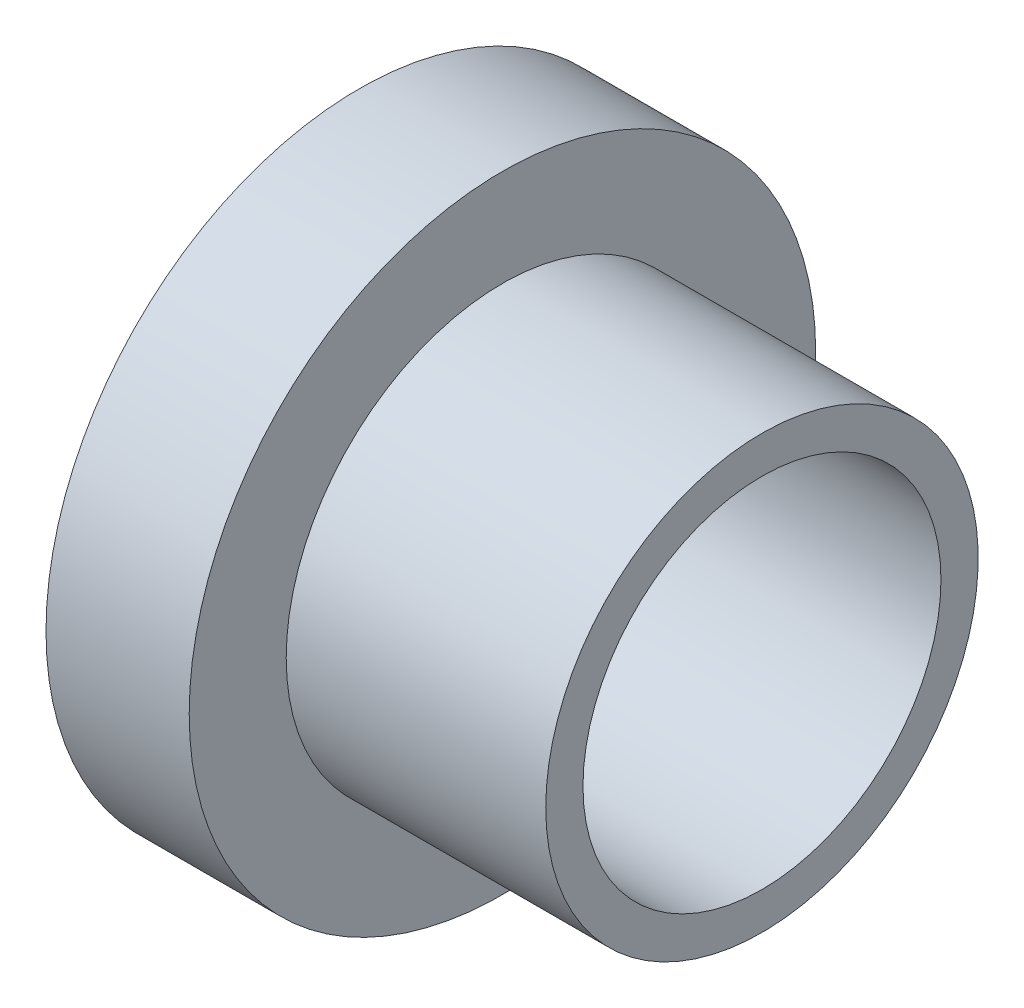
ISO-10303-21;
HEADER;
FILE_DESCRIPTION(('STEP AP214'),'2;1');
FILE_NAME('part.step','',(''),(''),'','','');
FILE_SCHEMA(('AUTOMOTIVE_DESIGN { 1 0 10303 214 1 1 1 1 }'));
ENDSEC;
DATA;
#1=APPLICATION_CONTEXT('core data for automotive mechanical design processes');
#2=APPLICATION_PROTOCOL_DEFINITION('international standard','automotive_design',2000,#1);
#3=PRODUCT_CONTEXT('',#1,'mechanical');
#4=PRODUCT('Part','Part','',(#3));
#5=PRODUCT_RELATED_PRODUCT_CATEGORY('part','',(#4));
#6=PRODUCT_DEFINITION_FORMATION('','',#4);
#7=PRODUCT_DEFINITION_CONTEXT('part definition',#1,'design');
#8=PRODUCT_DEFINITION('design','',#6,#7);
#9=PRODUCT_DEFINITION_SHAPE('','',#8);
#10=(LENGTH_UNIT() NAMED_UNIT(*) SI_UNIT(.MILLI.,.METRE.));
#11=(NAMED_UNIT(*) PLANE_ANGLE_UNIT() SI_UNIT($,.RADIAN.));
#12=(NAMED_UNIT(*) SI_UNIT($,.STERADIAN.) SOLID_ANGLE_UNIT());
#13=UNCERTAINTY_MEASURE_WITH_UNIT(LENGTH_MEASURE(1.E-05),#10,'distance_accuracy_value','');
#14=(GEOMETRIC_REPRESENTATION_CONTEXT(3) GLOBAL_UNCERTAINTY_ASSIGNED_CONTEXT((#13)) GLOBAL_UNIT_ASSIGNED_CONTEXT((#10,
#11,#12)) REPRESENTATION_CONTEXT('',''));
#15=CARTESIAN_POINT('',(0.,0.,0.));
#16=DIRECTION('',(0.,0.,1.));
#17=DIRECTION('',(1.,0.,0.));
#18=AXIS2_PLACEMENT_3D('',#15,#16,#17);
#19=CARTESIAN_POINT('',(0.,-5.,0.));
#20=DIRECTION('',(-1.,0.,0.));
#21=DIRECTION('',(0.,0.,1.));
#22=AXIS2_PLACEMENT_3D('',#19,#20,#21);
#23=CYLINDRICAL_SURFACE('',#22,5.);
#24=CARTESIAN_POINT('',(11.25,-5.,0.));
#25=DIRECTION('',(-1.,0.,0.));
#26=DIRECTION('',(0.,0.,1.));
#27=AXIS2_PLACEMENT_3D('',#24,#25,#26);
#28=CIRCLE('',#27,5.);
#29=CARTESIAN_POINT('',(11.25,-5.,5.));
#30=VERTEX_POINT('',#29);
#31=EDGE_CURVE('E10',#30,#30,#28,.T.);
#32=ORIENTED_EDGE('',*,*,#31,.F.);
#33=EDGE_LOOP('',(#32));
#34=FACE_BOUND('',#33,.T.);
#35=CARTESIAN_POINT('',(0.,-5.,0.));
#36=DIRECTION('',(-1.,0.,0.));
#37=DIRECTION('',(0.,0.,1.));
#38=AXIS2_PLACEMENT_3D('',#35,#36,#37);
#39=CIRCLE('',#38,5.);
#40=CARTESIAN_POINT('',(0.,-5.,5.));
#41=VERTEX_POINT('',#40);
#42=EDGE_CURVE('E53',#41,#41,#39,.T.);
#43=ORIENTED_EDGE('',*,*,#42,.T.);
#44=EDGE_LOOP('',(#43));
#45=FACE_BOUND('',#44,.T.);
#46=ADVANCED_FACE('F31',(#34,#45),#23,.F.);
#47=CARTESIAN_POINT('',(11.25,0.,0.));
#48=DIRECTION('',(-1.,0.,0.));
#49=DIRECTION('',(0.,0.,1.));
#50=AXIS2_PLACEMENT_3D('',#47,#48,#49);
#51=PLANE('',#50);
#52=CARTESIAN_POINT('',(11.25,-5.,0.));
#53=DIRECTION('',(-1.,0.,0.));
#54=DIRECTION('',(0.,0.,1.));
#55=AXIS2_PLACEMENT_3D('',#52,#53,#54);
#56=CIRCLE('',#55,6.04);
#57=CARTESIAN_POINT('',(11.25,-5.,6.04));
#58=VERTEX_POINT('',#57);
#59=EDGE_CURVE('E37',#58,#58,#56,.T.);
#60=ORIENTED_EDGE('',*,*,#59,.F.);
#61=EDGE_LOOP('',(#60));
#62=FACE_BOUND('',#61,.T.);
#63=ORIENTED_EDGE('',*,*,#31,.T.);
#64=EDGE_LOOP('',(#63));
#65=FACE_BOUND('',#64,.T.);
#66=ADVANCED_FACE('F78',(#62,#65),#51,.F.);
#67=CARTESIAN_POINT('',(0.,-5.,0.));
#68=DIRECTION('',(-1.,0.,0.));
#69=DIRECTION('',(0.,0.,1.));
#70=AXIS2_PLACEMENT_3D('',#67,#68,#69);
#71=CYLINDRICAL_SURFACE('',#70,6.04);
#72=CARTESIAN_POINT('',(4.,-5.,0.));
#73=DIRECTION('',(-1.,0.,0.));
#74=DIRECTION('',(0.,0.,1.));
#75=AXIS2_PLACEMENT_3D('',#72,#73,#74);
#76=CIRCLE('',#75,6.04);
#77=CARTESIAN_POINT('',(4.,-5.,6.04));
#78=VERTEX_POINT('',#77);
#79=EDGE_CURVE('E41',#78,#78,#76,.T.);
#80=ORIENTED_EDGE('',*,*,#79,.F.);
#81=EDGE_LOOP('',(#80));
#82=FACE_BOUND('',#81,.T.);
#83=ORIENTED_EDGE('',*,*,#59,.T.);
#84=EDGE_LOOP('',(#83));
#85=FACE_BOUND('',#84,.T.);
#86=ADVANCED_FACE('F73',(#82,#85),#71,.T.);
#87=CARTESIAN_POINT('',(4.,1.04,0.));
#88=DIRECTION('',(-1.,0.,0.));
#89=DIRECTION('',(0.,0.,1.));
#90=AXIS2_PLACEMENT_3D('',#87,#88,#89);
#91=PLANE('',#90);
#92=CARTESIAN_POINT('',(4.,-5.,0.));
#93=DIRECTION('',(-1.,0.,0.));
#94=DIRECTION('',(0.,0.,1.));
#95=AXIS2_PLACEMENT_3D('',#92,#93,#94);
#96=CIRCLE('',#95,8.75);
#97=CARTESIAN_POINT('',(4.,-5.,8.75));
#98=VERTEX_POINT('',#97);
#99=EDGE_CURVE('E45',#98,#98,#96,.T.);
#100=ORIENTED_EDGE('',*,*,#99,.F.);
#101=EDGE_LOOP('',(#100));
#102=FACE_BOUND('',#101,.T.);
#103=ORIENTED_EDGE('',*,*,#79,.T.);
#104=EDGE_LOOP('',(#103));
#105=FACE_BOUND('',#104,.T.);
#106=ADVANCED_FACE('F67',(#102,#105),#91,.F.);
#107=CARTESIAN_POINT('',(0.,-5.,0.));
#108=DIRECTION('',(-1.,0.,0.));
#109=DIRECTION('',(0.,0.,1.));
#110=AXIS2_PLACEMENT_3D('',#107,#108,#109);
#111=CYLINDRICAL_SURFACE('',#110,8.75);
#112=CARTESIAN_POINT('',(0.,-5.,0.));
#113=DIRECTION('',(-1.,0.,0.));
#114=DIRECTION('',(0.,0.,1.));
#115=AXIS2_PLACEMENT_3D('',#112,#113,#114);
#116=CIRCLE('',#115,8.75);
#117=CARTESIAN_POINT('',(0.,-5.,8.75));
#118=VERTEX_POINT('',#117);
#119=EDGE_CURVE('E50',#118,#118,#116,.T.);
#120=ORIENTED_EDGE('',*,*,#119,.F.);
#121=EDGE_LOOP('',(#120));
#122=FACE_BOUND('',#121,.T.);
#123=ORIENTED_EDGE('',*,*,#99,.T.);
#124=EDGE_LOOP('',(#123));
#125=FACE_BOUND('',#124,.T.);
#126=ADVANCED_FACE('F61',(#122,#125),#111,.T.);
#127=CARTESIAN_POINT('',(0.,0.,0.));
#128=DIRECTION('',(1.,0.,0.));
#129=DIRECTION('',(0.,0.,-1.));
#130=AXIS2_PLACEMENT_3D('',#127,#128,#129);
#131=PLANE('',#130);
#132=ORIENTED_EDGE('',*,*,#42,.F.);
#133=EDGE_LOOP('',(#132));
#134=FACE_BOUND('',#133,.T.);
#135=ORIENTED_EDGE('',*,*,#119,.T.);
#136=EDGE_LOOP('',(#135));
#137=FACE_BOUND('',#136,.T.);
#138=ADVANCED_FACE('F58',(#134,#137),#131,.F.);
#139=CLOSED_SHELL('',(#46,#66,#86,#106,#126,#138));
#140=MANIFOLD_SOLID_BREP('B2',#139);
#141=ADVANCED_BREP_SHAPE_REPRESENTATION('',(#18,#140),#14);
#142=SHAPE_DEFINITION_REPRESENTATION(#9,#141);
ENDSEC;
END-ISO-10303-21;
